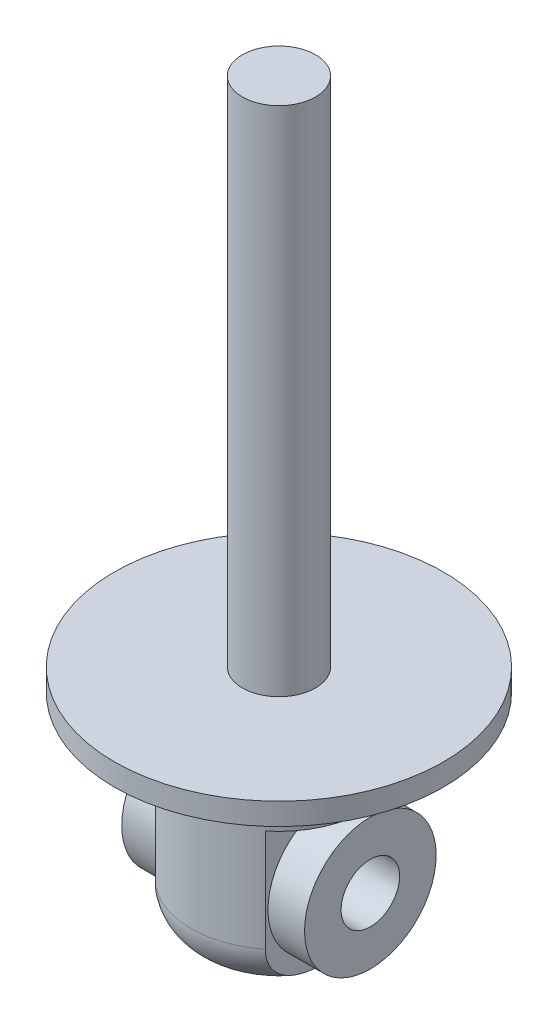
ISO-10303-21;
HEADER;
FILE_DESCRIPTION(('STEP AP214'),'2;1');
FILE_NAME('part.step','',(''),(''),'','','');
FILE_SCHEMA(('AUTOMOTIVE_DESIGN { 1 0 10303 214 1 1 1 1 }'));
ENDSEC;
DATA;
#1=APPLICATION_CONTEXT('core data for automotive mechanical design processes');
#2=APPLICATION_PROTOCOL_DEFINITION('international standard','automotive_design',2000,#1);
#3=PRODUCT_CONTEXT('',#1,'mechanical');
#4=PRODUCT('Part','Part','',(#3));
#5=PRODUCT_RELATED_PRODUCT_CATEGORY('part','',(#4));
#6=PRODUCT_DEFINITION_FORMATION('','',#4);
#7=PRODUCT_DEFINITION_CONTEXT('part definition',#1,'design');
#8=PRODUCT_DEFINITION('design','',#6,#7);
#9=PRODUCT_DEFINITION_SHAPE('','',#8);
#10=(LENGTH_UNIT() NAMED_UNIT(*) SI_UNIT(.MILLI.,.METRE.));
#11=(NAMED_UNIT(*) PLANE_ANGLE_UNIT() SI_UNIT($,.RADIAN.));
#12=(NAMED_UNIT(*) SI_UNIT($,.STERADIAN.) SOLID_ANGLE_UNIT());
#13=UNCERTAINTY_MEASURE_WITH_UNIT(LENGTH_MEASURE(1.E-05),#10,'distance_accuracy_value','');
#14=(GEOMETRIC_REPRESENTATION_CONTEXT(3) GLOBAL_UNCERTAINTY_ASSIGNED_CONTEXT((#13)) GLOBAL_UNIT_ASSIGNED_CONTEXT((#10,
#11,#12)) REPRESENTATION_CONTEXT('',''));
#15=CARTESIAN_POINT('',(0.,0.,0.));
#16=DIRECTION('',(0.,0.,1.));
#17=DIRECTION('',(1.,0.,0.));
#18=AXIS2_PLACEMENT_3D('',#15,#16,#17);
#19=CARTESIAN_POINT('',(-30.,18.1486401523121,-90.0000068191871));
#20=DIRECTION('',(-1.,0.,0.));
#21=DIRECTION('',(0.,0.,1.));
#22=AXIS2_PLACEMENT_3D('',#19,#20,#21);
#23=PLANE('',#22);
#24=DIRECTION('',(0.,1.,0.));
#25=VECTOR('',#24,1.);
#26=CARTESIAN_POINT('',(-30.,-93.8513598476879,37.4699811712033));
#27=LINE('',#26,#25);
#28=CARTESIAN_POINT('',(-30.,-69.8513598476879,37.4699811712033));
#29=VERTEX_POINT('',#28);
#30=CARTESIAN_POINT('',(-30.,-13.8513598476879,37.4699811712033));
#31=VERTEX_POINT('',#30);
#32=EDGE_CURVE('E95',#29,#31,#27,.T.);
#33=ORIENTED_EDGE('',*,*,#32,.T.);
#34=DIRECTION('',(0.,0.,1.));
#35=VECTOR('',#34,1.);
#36=CARTESIAN_POINT('',(-30.,-13.8513598476879,-90.0000068191871));
#37=LINE('',#36,#35);
#38=CARTESIAN_POINT('',(-30.,-13.8513598476879,-37.4699948095775));
#39=VERTEX_POINT('',#38);
#40=EDGE_CURVE('E88',#39,#31,#37,.T.);
#41=ORIENTED_EDGE('',*,*,#40,.F.);
#42=DIRECTION('',(0.,1.,0.));
#43=VECTOR('',#42,1.);
#44=CARTESIAN_POINT('',(-30.,-93.8513598476879,-37.4699948095775));
#45=LINE('',#44,#43);
#46=CARTESIAN_POINT('',(-30.,-69.8513598476879,-37.4699948095775));
#47=VERTEX_POINT('',#46);
#48=EDGE_CURVE('E66',#39,#47,#45,.F.);
#49=ORIENTED_EDGE('',*,*,#48,.T.);
#50=CARTESIAN_POINT('',(-30.,-93.0892599249325,-6.81918706807246E-06));
#51=CARTESIAN_POINT('',(-30.,-93.0892611316607,-0.738052198363597));
#52=CARTESIAN_POINT('',(-30.,-93.0822687729148,-1.47609878089435));
#53=CARTESIAN_POINT('',(-30.,-93.0538144609904,-2.95192256399121));
#54=CARTESIAN_POINT('',(-30.,-93.0323524208549,-3.68969976291177));
#55=CARTESIAN_POINT('',(-30.,-92.9735135445675,-5.16491830483081));
#56=CARTESIAN_POINT('',(-30.,-92.9361306127906,-5.90235941077961));
#57=CARTESIAN_POINT('',(-30.,-92.8431615265196,-7.37609889264012));
#58=CARTESIAN_POINT('',(-30.,-92.7875755883894,-8.11239728202985));
#59=CARTESIAN_POINT('',(-30.,-92.6554566514908,-9.58009944369346));
#60=CARTESIAN_POINT('',(-30.,-92.579011380416,-10.3115108567778));
#61=CARTESIAN_POINT('',(-30.,-92.4015633968189,-11.7713146252248));
#62=CARTESIAN_POINT('',(-30.,-92.3005595739555,-12.4997068425689));
#63=CARTESIAN_POINT('',(-30.,-91.9550034282887,-14.6771646082477));
#64=CARTESIAN_POINT('',(-30.,-91.6677752670836,-16.1201655961783));
#65=CARTESIAN_POINT('',(-30.,-91.1118586745832,-18.3172798826585));
#66=CARTESIAN_POINT('',(-30.,-90.8947929455916,-19.0845664150221));
#67=CARTESIAN_POINT('',(-30.,-90.4124385377801,-20.6040639521541));
#68=CARTESIAN_POINT('',(-30.,-90.1471476929338,-21.3562742780906));
#69=CARTESIAN_POINT('',(-30.,-89.5639546351373,-22.8397070720282));
#70=CARTESIAN_POINT('',(-30.,-89.2460790400504,-23.5709399399755));
#71=CARTESIAN_POINT('',(-30.,-88.5538497312742,-25.0062420015668));
#72=CARTESIAN_POINT('',(-30.,-88.1795056276223,-25.7103157916986));
#73=CARTESIAN_POINT('',(-30.,-87.4347350500955,-26.9765216567793));
#74=CARTESIAN_POINT('',(-30.,-87.0728165333311,-27.5436560514389));
#75=CARTESIAN_POINT('',(-30.,-86.3059797907543,-28.6481491240313));
#76=CARTESIAN_POINT('',(-30.,-85.9010643815308,-29.1855097488436));
#77=CARTESIAN_POINT('',(-30.,-85.04808898298,-30.2251049216939));
#78=CARTESIAN_POINT('',(-30.,-84.6000208874599,-30.7273328393761));
#79=CARTESIAN_POINT('',(-30.,-83.6616854180347,-31.6908217970935));
#80=CARTESIAN_POINT('',(-30.,-83.1714177258861,-32.1520825281261));
#81=CARTESIAN_POINT('',(-30.,-82.1460914034153,-33.0316570706357));
#82=CARTESIAN_POINT('',(-30.,-81.6106753795654,-33.4495555339472));
#83=CARTESIAN_POINT('',(-30.,-80.5019291528832,-34.2318052919914));
#84=CARTESIAN_POINT('',(-30.,-79.928597543178,-34.5961545981429));
#85=CARTESIAN_POINT('',(-30.,-78.7487234624922,-35.2654660856642));
#86=CARTESIAN_POINT('',(-30.,-78.1422047230445,-35.5704700108283));
#87=CARTESIAN_POINT('',(-30.,-76.9009978754799,-36.1163765502656));
#88=CARTESIAN_POINT('',(-30.,-76.2663151952074,-36.3572914539144));
#89=CARTESIAN_POINT('',(-30.,-75.0722609736202,-36.739811611724));
#90=CARTESIAN_POINT('',(-30.,-74.5159103396078,-36.8909014297051));
#91=CARTESIAN_POINT('',(-30.,-73.3918009912041,-37.1419233581533));
#92=CARTESIAN_POINT('',(-30.,-72.824043570507,-37.2418612363285));
#93=CARTESIAN_POINT('',(-30.,-71.6819996799629,-37.3892324892831));
#94=CARTESIAN_POINT('',(-30.,-71.1077160749104,-37.4366880661924));
#95=CARTESIAN_POINT('',(-30.,-69.9572192877116,-37.4785333954683));
#96=CARTESIAN_POINT('',(-30.,-69.3810061734218,-37.4729249947871));
#97=CARTESIAN_POINT('',(-30.,-68.2760233941342,-37.4112147049101));
#98=CARTESIAN_POINT('',(-30.,-67.7470294508587,-37.3590495480717));
#99=CARTESIAN_POINT('',(-30.,-66.6953717541003,-37.2102239386462));
#100=CARTESIAN_POINT('',(-30.,-66.1727075674064,-37.1135665489885));
#101=CARTESIAN_POINT('',(-30.,-65.137433890027,-36.8768691294685));
#102=CARTESIAN_POINT('',(-30.,-64.6248222375744,-36.7368385381173));
#103=CARTESIAN_POINT('',(-30.,-63.6129195009735,-36.4149236425133));
#104=CARTESIAN_POINT('',(-30.,-63.1136287487036,-36.2330382965711));
#105=CARTESIAN_POINT('',(-30.,-62.1280878985299,-35.8279581985301));
#106=CARTESIAN_POINT('',(-30.,-61.6419515087085,-35.6044871560991));
#107=CARTESIAN_POINT('',(-30.,-60.6891363553551,-35.1193972117624));
#108=CARTESIAN_POINT('',(-30.,-60.2224574643725,-34.8577785597818));
#109=CARTESIAN_POINT('',(-30.,-59.310773908771,-34.2988771365567));
#110=CARTESIAN_POINT('',(-30.,-58.8657769727852,-34.0015817770705));
#111=CARTESIAN_POINT('',(-30.,-57.9995739133805,-33.3741742734401));
#112=CARTESIAN_POINT('',(-30.,-57.5783688426015,-33.0440606790763));
#113=CARTESIAN_POINT('',(-30.,-56.7293350556522,-32.3269361932505));
#114=CARTESIAN_POINT('',(-30.,-56.3035594479762,-31.9374950764825));
#115=CARTESIAN_POINT('',(-30.,-55.4827570971635,-31.1275174828152));
#116=CARTESIAN_POINT('',(-30.,-55.0877312041988,-30.7069801467901));
#117=CARTESIAN_POINT('',(-30.,-54.3293265039809,-29.8386238330802));
#118=CARTESIAN_POINT('',(-30.,-53.9659349215399,-29.3908159936417));
#119=CARTESIAN_POINT('',(-30.,-53.2707864350541,-28.4712385046426));
#120=CARTESIAN_POINT('',(-30.,-52.9390363688606,-27.9994637093405));
#121=CARTESIAN_POINT('',(-30.,-52.1493074181579,-26.7947904121129));
#122=CARTESIAN_POINT('',(-30.,-51.7108854708201,-26.0490011637348));
#123=CARTESIAN_POINT('',(-30.,-50.9020716606715,-24.5213303960724));
#124=CARTESIAN_POINT('',(-30.,-50.5317123306957,-23.7394318393898));
#125=CARTESIAN_POINT('',(-30.,-49.8539005931896,-22.1463721782566));
#126=CARTESIAN_POINT('',(-30.,-49.5466308919115,-21.3351338688782));
#127=CARTESIAN_POINT('',(-30.,-48.990849279687,-19.6932432865343));
#128=CARTESIAN_POINT('',(-30.,-48.7423210565885,-18.8625964737647));
#129=CARTESIAN_POINT('',(-30.,-48.2629337769052,-17.0573373338172));
#130=CARTESIAN_POINT('',(-30.,-48.040828221803,-16.0804193679996));
#131=CARTESIAN_POINT('',(-30.,-47.6559178919993,-14.1149201518687));
#132=CARTESIAN_POINT('',(-30.,-47.4931322311057,-13.1263352480245));
#133=CARTESIAN_POINT('',(-30.,-47.2163378803163,-11.140289851927));
#134=CARTESIAN_POINT('',(-30.,-47.102436720032,-10.1428146701659));
#135=CARTESIAN_POINT('',(-30.,-46.9616088660944,-8.6439788310222));
#136=CARTESIAN_POINT('',(-30.,-46.9196712276942,-8.14394829683787));
#137=CARTESIAN_POINT('',(-30.,-46.8448164166611,-7.14321213759518));
#138=CARTESIAN_POINT('',(-30.,-46.8118991301461,-6.64250652113995));
#139=CARTESIAN_POINT('',(-30.,-46.7540692721684,-5.6380618556896));
#140=CARTESIAN_POINT('',(-30.,-46.729198661424,-5.1343204298399));
#141=CARTESIAN_POINT('',(-30.,-46.6869836847153,-4.1265321744669));
#142=CARTESIAN_POINT('',(-30.,-46.6696392052213,-3.62248534966533));
#143=CARTESIAN_POINT('',(-30.,-46.6419472390074,-2.61417711028704));
#144=CARTESIAN_POINT('',(-30.,-46.6316000943294,-2.10991568642577));
#145=CARTESIAN_POINT('',(-30.,-46.6175757344641,-1.1012996440096));
#146=CARTESIAN_POINT('',(-30.,-46.6138985375758,-0.596945025202812));
#147=CARTESIAN_POINT('',(-30.,-46.613095256448,0.411163385613465));
#148=CARTESIAN_POINT('',(-30.,-46.6159613065268,0.914917171444938));
#149=CARTESIAN_POINT('',(-30.,-46.628321309575,1.92234597200099));
#150=CARTESIAN_POINT('',(-30.,-46.6378152851368,2.42602098645122));
#151=CARTESIAN_POINT('',(-30.,-46.6637318481209,3.43315472088317));
#152=CARTESIAN_POINT('',(-30.,-46.6801538847655,3.93661345487485));
#153=CARTESIAN_POINT('',(-30.,-46.7204282328483,4.94322788363524));
#154=CARTESIAN_POINT('',(-30.,-46.7442804266004,5.44638358307725));
#155=CARTESIAN_POINT('',(-30.,-46.8027636425445,6.50023992410521));
#156=CARTESIAN_POINT('',(-30.,-46.8382059876979,7.05089623266971));
#157=CARTESIAN_POINT('',(-30.,-46.919957971471,8.15140187734522));
#158=CARTESIAN_POINT('',(-30.,-46.966267496773,8.70125122181071));
#159=CARTESIAN_POINT('',(-30.,-47.0710989801583,9.79989486485605));
#160=CARTESIAN_POINT('',(-30.,-47.1296229826125,10.3486889712801));
#161=CARTESIAN_POINT('',(-30.,-47.260379767074,11.4446308569511));
#162=CARTESIAN_POINT('',(-30.,-47.3326125428379,11.9917786369477));
#163=CARTESIAN_POINT('',(-30.,-47.5715585799602,13.6248737418128));
#164=CARTESIAN_POINT('',(-30.,-47.7609838531774,14.7076553969787));
#165=CARTESIAN_POINT('',(-30.,-48.2141857445342,16.8575846999504));
#166=CARTESIAN_POINT('',(-30.,-48.4779382081889,17.9247373084835));
#167=CARTESIAN_POINT('',(-30.,-49.0160585174062,19.7685804752265));
#168=CARTESIAN_POINT('',(-30.,-49.2711097031378,20.5508843619595));
#169=CARTESIAN_POINT('',(-30.,-49.835763414559,22.0957231375065));
#170=CARTESIAN_POINT('',(-30.,-50.1453667211977,22.8582577431309));
#171=CARTESIAN_POINT('',(-30.,-50.8237006897191,24.356907996577));
#172=CARTESIAN_POINT('',(-30.,-51.1924326101962,25.0930230816321));
#173=CARTESIAN_POINT('',(-30.,-51.7921426850689,26.1709549249958));
#174=CARTESIAN_POINT('',(-30.,-51.999799681092,26.525869785905));
#175=CARTESIAN_POINT('',(-30.,-52.4310209415023,27.2260387321158));
#176=CARTESIAN_POINT('',(-30.,-52.6545891732071,27.5712903778755));
#177=CARTESIAN_POINT('',(-30.,-53.2464309242116,28.4396035161559));
#178=CARTESIAN_POINT('',(-30.,-53.6261280631121,28.9549572541211));
#179=CARTESIAN_POINT('',(-30.,-54.4244336347113,29.9544432671431));
#180=CARTESIAN_POINT('',(-30.,-54.8430332509361,30.4385825744085));
#181=CARTESIAN_POINT('',(-30.,-55.7185409335278,31.3708069946439));
#182=CARTESIAN_POINT('',(-30.,-56.1754406165184,31.8188999558184));
#183=CARTESIAN_POINT('',(-30.,-57.1261897842569,32.6741274509997));
#184=CARTESIAN_POINT('',(-30.,-57.6200399677405,33.0812612101246));
#185=CARTESIAN_POINT('',(-30.,-58.6461732042846,33.8524397493987));
#186=CARTESIAN_POINT('',(-30.,-59.1787151111166,34.2161410164972));
#187=CARTESIAN_POINT('',(-30.,-60.2756443842691,34.8920128006311));
#188=CARTESIAN_POINT('',(-30.,-60.8400325473068,35.20418202769));
#189=CARTESIAN_POINT('',(-30.,-61.9961874594725,35.7723720464126));
#190=CARTESIAN_POINT('',(-30.,-62.5879438775699,36.0284138190565));
#191=CARTESIAN_POINT('',(-30.,-63.793911950484,36.4805676203198));
#192=CARTESIAN_POINT('',(-30.,-64.4081204213939,36.6766881096964));
#193=CARTESIAN_POINT('',(-30.,-65.5768155799712,36.9857288686384));
#194=CARTESIAN_POINT('',(-30.,-66.1293949347761,37.1059005642837));
#195=CARTESIAN_POINT('',(-30.,-67.2430859659713,37.296238896397));
#196=CARTESIAN_POINT('',(-30.,-67.8041968699957,37.3664100322382));
#197=CARTESIAN_POINT('',(-30.,-68.9302382881383,37.455833275237));
#198=CARTESIAN_POINT('',(-30.,-69.4951672234347,37.4751052758845));
#199=CARTESIAN_POINT('',(-30.,-70.6244535976211,37.4625377321111));
#200=CARTESIAN_POINT('',(-30.,-71.1888110505129,37.4306994718235));
#201=CARTESIAN_POINT('',(-30.,-72.2770638413488,37.319925635093));
#202=CARTESIAN_POINT('',(-30.,-72.8012758257346,37.2440710470996));
#203=CARTESIAN_POINT('',(-30.,-73.8414667937806,37.0486995362486));
#204=CARTESIAN_POINT('',(-30.,-74.3574462404068,36.9291850777487));
#205=CARTESIAN_POINT('',(-30.,-75.3776517364844,36.6478282433836));
#206=CARTESIAN_POINT('',(-30.,-75.8818790847987,36.4859905695482));
#207=CARTESIAN_POINT('',(-30.,-76.8754410114704,36.1217165848684));
#208=CARTESIAN_POINT('',(-30.,-77.3647751791612,35.9192791556868));
#209=CARTESIAN_POINT('',(-30.,-78.3336699712591,35.472205623011));
#210=CARTESIAN_POINT('',(-30.,-78.8129315899242,35.2269221865305));
#211=CARTESIAN_POINT('',(-30.,-79.7504290614741,34.6990772361913));
#212=CARTESIAN_POINT('',(-30.,-80.20866490053,34.4165156978148));
#213=CARTESIAN_POINT('',(-30.,-81.102008010542,33.8167991465054));
#214=CARTESIAN_POINT('',(-30.,-81.5371106229795,33.4996372047693));
#215=CARTESIAN_POINT('',(-30.,-82.382354122105,32.8336631307682));
#216=CARTESIAN_POINT('',(-30.,-82.7924938874912,32.4848495785004));
#217=CARTESIAN_POINT('',(-30.,-83.6212582978309,31.7267637725649));
#218=CARTESIAN_POINT('',(-30.,-84.0374864085922,31.3148719755993));
#219=CARTESIAN_POINT('',(-30.,-84.8378013152369,30.4610261306246));
#220=CARTESIAN_POINT('',(-30.,-85.2218870497033,30.0190710907295));
#221=CARTESIAN_POINT('',(-30.,-85.9574549927598,29.1088228532463));
#222=CARTESIAN_POINT('',(-30.,-86.3089354615389,28.6405282523232));
#223=CARTESIAN_POINT('',(-30.,-86.9793740502017,27.6811571970972));
#224=CARTESIAN_POINT('',(-30.,-87.2983246593579,27.1900755194596));
#225=CARTESIAN_POINT('',(-30.,-88.0691877143732,25.9156883561653));
#226=CARTESIAN_POINT('',(-30.,-88.4989160842426,25.1188847962624));
#227=CARTESIAN_POINT('',(-30.,-89.2856458140668,23.4901092399801));
#228=CARTESIAN_POINT('',(-30.,-89.6426122273919,22.6581205751907));
#229=CARTESIAN_POINT('',(-30.,-90.2898326401251,20.9672411376953));
#230=CARTESIAN_POINT('',(-30.,-90.5799763629775,20.1083085159763));
#231=CARTESIAN_POINT('',(-30.,-91.0997695867003,18.3721819773498));
#232=CARTESIAN_POINT('',(-30.,-91.3293964132553,17.4949813482813));
#233=CARTESIAN_POINT('',(-30.,-91.6883385112106,15.9340832319027));
#234=CARTESIAN_POINT('',(-30.,-91.8285626417853,15.2528412719452));
#235=CARTESIAN_POINT('',(-30.,-92.0812643111244,13.8854123657106));
#236=CARTESIAN_POINT('',(-30.,-92.1937479229421,13.1992265356788));
#237=CARTESIAN_POINT('',(-30.,-92.3944937666707,11.8229159102374));
#238=CARTESIAN_POINT('',(-30.,-92.4827403005,11.1327888560953));
#239=CARTESIAN_POINT('',(-30.,-92.6381481818878,9.75015460022858));
#240=CARTESIAN_POINT('',(-30.,-92.7053082968371,9.05764726175541));
#241=CARTESIAN_POINT('',(-30.,-92.8216032432864,7.66895510798233));
#242=CARTESIAN_POINT('',(-30.,-92.8706808139922,6.97276557322258));
#243=CARTESIAN_POINT('',(-30.,-92.9529494773895,5.57947661606538));
#244=CARTESIAN_POINT('',(-30.,-92.9861408335073,4.8823772089477));
#245=CARTESIAN_POINT('',(-30.,-93.0384716333854,3.48784684379134));
#246=CARTESIAN_POINT('',(-30.,-93.0576148123181,2.79041602325476));
#247=CARTESIAN_POINT('',(-30.,-93.0830084202225,1.39532155461287));
#248=CARTESIAN_POINT('',(-30.,-93.0892587842279,0.697657905352055));
#249=CARTESIAN_POINT('',(-30.,-93.0892599249325,-6.81918706807246E-06));
#250=B_SPLINE_CURVE_WITH_KNOTS('',3,(#50,#51,#52,#53,#54,#55,#56,#57,#58,#59,#60,#61,#62,#63,
#64,#65,#66,#67,#68,#69,#70,#71,#72,#73,#74,#75,#76,#77,#78,#79,#80,#81,#82,#83,#84,#85,#86,#87,
#88,#89,#90,#91,#92,#93,#94,#95,#96,#97,#98,#99,#100,#101,#102,#103,#104,#105,#106,#107,#108,
#109,#110,#111,#112,#113,#114,#115,#116,#117,#118,#119,#120,#121,#122,#123,#124,#125,#126,#127,
#128,#129,#130,#131,#132,#133,#134,#135,#136,#137,#138,#139,#140,#141,#142,#143,#144,#145,#146,
#147,#148,#149,#150,#151,#152,#153,#154,#155,#156,#157,#158,#159,#160,#161,#162,#163,#164,#165,
#166,#167,#168,#169,#170,#171,#172,#173,#174,#175,#176,#177,#178,#179,#180,#181,#182,#183,#184,
#185,#186,#187,#188,#189,#190,#191,#192,#193,#194,#195,#196,#197,#198,#199,#200,#201,#202,#203,
#204,#205,#206,#207,#208,#209,#210,#211,#212,#213,#214,#215,#216,#217,#218,#219,#220,#221,#222,
#223,#224,#225,#226,#227,#228,#229,#230,#231,#232,#233,#234,#235,#236,#237,#238,#239,#240,#241,
#242,#243,#244,#245,#246,#247,#248,#249),.UNSPECIFIED.,.T.,.F.,(4,2,2,2,2,2,2,2,2,2,2,2,2,2,2,2,
2,2,2,2,2,2,2,2,2,2,2,2,2,2,2,2,2,2,2,2,2,2,2,2,2,2,2,2,2,2,2,2,2,2,2,2,2,2,2,2,2,2,2,2,2,2,2,2,
2,2,2,2,2,2,2,2,2,2,2,2,2,2,2,2,2,2,2,2,2,2,2,2,2,2,2,2,2,2,2,2,2,2,2,4),(0.,2.21410330807653,
4.42821992214618,6.64318501727892,8.85812378592945,11.0638871062463,13.2697501720634,
17.6765078037139,20.0674267702985,22.4584531513217,24.8482729020421,27.2376864015397,
29.254159466955,31.2705005210631,33.2872210845387,35.3039568582163,37.3385068375633,
39.3731323521038,41.4063214870767,43.4391204668517,45.166343421461,46.8933715777161,
48.6196688516129,50.3459060399882,51.938702610761,53.531389546801,55.1237301389257,
56.7161103658282,58.3194745274512,59.922828185062,61.5267492458629,63.1307412145684,
64.8600382553431,66.5893830909627,68.3180262770983,70.0470421871384,72.6383221057377,
75.2308374110988,77.8307578635283,80.4299554833424,83.4332317454108,86.4374748566922,
89.448292847705,90.9535902133531,92.4588685737193,93.9718744700121,95.4848575422015,
96.9979145662968,98.5109757414482,100.022219013334,101.53346743654,103.044595738806,
104.555700107546,106.210989398991,107.86626143065,109.521810732272,111.177359279911,
114.472866133878,117.767303262801,120.234018615271,122.700769283245,125.167572464727,
126.400813220428,127.63436255782,129.552808392758,131.470820505396,133.388413881442,
135.306043528434,137.237955740522,139.169916305893,141.101153449708,143.032117780814,
144.726405316987,146.420540370965,148.114013188755,149.807443459104,151.394602139799,
152.981671248024,154.568564110702,156.155500691009,157.768897601399,159.382295572924,
160.996017225885,162.609811311916,164.364782507237,166.119811632991,167.874934352988,
169.630461395286,172.342030445901,175.054898775371,177.772212536212,180.490542970406,
182.576521556741,184.662043067018,186.748912177602,188.835903253678,190.929447394874,
193.02295681957,195.115909413669,197.20887255403),.UNSPECIFIED.);
#251=EDGE_CURVE('E145',#29,#47,#250,.T.);
#252=ORIENTED_EDGE('',*,*,#251,.F.);
#253=EDGE_LOOP('',(#33,#41,#49,#252));
#254=FACE_BOUND('',#253,.T.);
#255=CARTESIAN_POINT('',(-30.,-51.983828865234,-6.81918706807246E-06));
#256=DIRECTION('',(-1.,0.,0.));
#257=DIRECTION('',(0.,0.,1.));
#258=AXIS2_PLACEMENT_3D('',#255,#256,#257);
#259=CIRCLE('',#258,36.);
#260=CARTESIAN_POINT('',(-30.,-51.983828865234,35.9999931808129));
#261=VERTEX_POINT('',#260);
#262=EDGE_CURVE('E98',#261,#261,#259,.F.);
#263=ORIENTED_EDGE('',*,*,#262,.T.);
#264=EDGE_LOOP('',(#263));
#265=FACE_BOUND('',#264,.T.);
#266=ADVANCED_FACE('F41',(#254,#265),#23,.T.);
#267=CARTESIAN_POINT('',(30.,18.1486401523121,-90.0000068191871));
#268=DIRECTION('',(-1.,0.,0.));
#269=DIRECTION('',(0.,0.,1.));
#270=AXIS2_PLACEMENT_3D('',#267,#268,#269);
#271=PLANE('',#270);
#272=CARTESIAN_POINT('',(30.,-93.0892599249325,-6.81918706807246E-06));
#273=CARTESIAN_POINT('',(30.,-93.0892611316607,-0.738052198363597));
#274=CARTESIAN_POINT('',(30.,-93.0822687729148,-1.47609878089435));
#275=CARTESIAN_POINT('',(30.,-93.0538144609904,-2.95192256399121));
#276=CARTESIAN_POINT('',(30.,-93.0323524208549,-3.68969976291177));
#277=CARTESIAN_POINT('',(30.,-92.9735135445675,-5.16491830483081));
#278=CARTESIAN_POINT('',(30.,-92.9361306127906,-5.90235941077961));
#279=CARTESIAN_POINT('',(30.,-92.8431615265196,-7.37609889264012));
#280=CARTESIAN_POINT('',(30.,-92.7875755883894,-8.11239728202985));
#281=CARTESIAN_POINT('',(30.,-92.6554566514908,-9.58009944369346));
#282=CARTESIAN_POINT('',(30.,-92.579011380416,-10.3115108567778));
#283=CARTESIAN_POINT('',(30.,-92.4015633968189,-11.7713146252248));
#284=CARTESIAN_POINT('',(30.,-92.3005595739555,-12.4997068425689));
#285=CARTESIAN_POINT('',(30.,-91.9550034282887,-14.6771646082477));
#286=CARTESIAN_POINT('',(30.,-91.6677752670836,-16.1201655961783));
#287=CARTESIAN_POINT('',(30.,-91.1118586745832,-18.3172798826585));
#288=CARTESIAN_POINT('',(30.,-90.8947929455916,-19.0845664150221));
#289=CARTESIAN_POINT('',(30.,-90.4124385377801,-20.6040639521541));
#290=CARTESIAN_POINT('',(30.,-90.1471476929338,-21.3562742780906));
#291=CARTESIAN_POINT('',(30.,-89.5639546351373,-22.8397070720282));
#292=CARTESIAN_POINT('',(30.,-89.2460790400504,-23.5709399399755));
#293=CARTESIAN_POINT('',(30.,-88.5538497312742,-25.0062420015668));
#294=CARTESIAN_POINT('',(30.,-88.1795056276223,-25.7103157916986));
#295=CARTESIAN_POINT('',(30.,-87.4347350500955,-26.9765216567793));
#296=CARTESIAN_POINT('',(30.,-87.0728165333311,-27.5436560514389));
#297=CARTESIAN_POINT('',(30.,-86.3059797907543,-28.6481491240313));
#298=CARTESIAN_POINT('',(30.,-85.9010643815308,-29.1855097488436));
#299=CARTESIAN_POINT('',(30.,-85.04808898298,-30.2251049216939));
#300=CARTESIAN_POINT('',(30.,-84.6000208874599,-30.7273328393761));
#301=CARTESIAN_POINT('',(30.,-83.6616854180347,-31.6908217970935));
#302=CARTESIAN_POINT('',(30.,-83.1714177258861,-32.1520825281261));
#303=CARTESIAN_POINT('',(30.,-82.1460914034153,-33.0316570706357));
#304=CARTESIAN_POINT('',(30.,-81.6106753795654,-33.4495555339472));
#305=CARTESIAN_POINT('',(30.,-80.5019291528832,-34.2318052919914));
#306=CARTESIAN_POINT('',(30.,-79.928597543178,-34.5961545981429));
#307=CARTESIAN_POINT('',(30.,-78.7487234624922,-35.2654660856642));
#308=CARTESIAN_POINT('',(30.,-78.1422047230445,-35.5704700108283));
#309=CARTESIAN_POINT('',(30.,-76.9009978754799,-36.1163765502656));
#310=CARTESIAN_POINT('',(30.,-76.2663151952074,-36.3572914539144));
#311=CARTESIAN_POINT('',(30.,-75.0722609736202,-36.739811611724));
#312=CARTESIAN_POINT('',(30.,-74.5159103396078,-36.8909014297051));
#313=CARTESIAN_POINT('',(30.,-73.3918009912041,-37.1419233581533));
#314=CARTESIAN_POINT('',(30.,-72.824043570507,-37.2418612363285));
#315=CARTESIAN_POINT('',(30.,-71.6819996799629,-37.3892324892831));
#316=CARTESIAN_POINT('',(30.,-71.1077160749104,-37.4366880661924));
#317=CARTESIAN_POINT('',(30.,-69.9572192877116,-37.4785333954683));
#318=CARTESIAN_POINT('',(30.,-69.3810061734218,-37.4729249947871));
#319=CARTESIAN_POINT('',(30.,-68.2760233941342,-37.4112147049101));
#320=CARTESIAN_POINT('',(30.,-67.7470294508587,-37.3590495480717));
#321=CARTESIAN_POINT('',(30.,-66.6953717541003,-37.2102239386462));
#322=CARTESIAN_POINT('',(30.,-66.1727075674064,-37.1135665489885));
#323=CARTESIAN_POINT('',(30.,-65.137433890027,-36.8768691294685));
#324=CARTESIAN_POINT('',(30.,-64.6248222375744,-36.7368385381173));
#325=CARTESIAN_POINT('',(30.,-63.6129195009735,-36.4149236425133));
#326=CARTESIAN_POINT('',(30.,-63.1136287487036,-36.2330382965711));
#327=CARTESIAN_POINT('',(30.,-62.1280878985299,-35.8279581985301));
#328=CARTESIAN_POINT('',(30.,-61.6419515087085,-35.6044871560991));
#329=CARTESIAN_POINT('',(30.,-60.6891363553551,-35.1193972117624));
#330=CARTESIAN_POINT('',(30.,-60.2224574643725,-34.8577785597818));
#331=CARTESIAN_POINT('',(30.,-59.310773908771,-34.2988771365567));
#332=CARTESIAN_POINT('',(30.,-58.8657769727852,-34.0015817770705));
#333=CARTESIAN_POINT('',(30.,-57.9995739133805,-33.3741742734401));
#334=CARTESIAN_POINT('',(30.,-57.5783688426015,-33.0440606790763));
#335=CARTESIAN_POINT('',(30.,-56.7293350556522,-32.3269361932505));
#336=CARTESIAN_POINT('',(30.,-56.3035594479762,-31.9374950764825));
#337=CARTESIAN_POINT('',(30.,-55.4827570971635,-31.1275174828152));
#338=CARTESIAN_POINT('',(30.,-55.0877312041988,-30.7069801467901));
#339=CARTESIAN_POINT('',(30.,-54.3293265039809,-29.8386238330802));
#340=CARTESIAN_POINT('',(30.,-53.9659349215399,-29.3908159936417));
#341=CARTESIAN_POINT('',(30.,-53.2707864350541,-28.4712385046426));
#342=CARTESIAN_POINT('',(30.,-52.9390363688606,-27.9994637093405));
#343=CARTESIAN_POINT('',(30.,-52.1493074181579,-26.7947904121129));
#344=CARTESIAN_POINT('',(30.,-51.7108854708201,-26.0490011637348));
#345=CARTESIAN_POINT('',(30.,-50.9020716606715,-24.5213303960724));
#346=CARTESIAN_POINT('',(30.,-50.5317123306957,-23.7394318393898));
#347=CARTESIAN_POINT('',(30.,-49.8539005931896,-22.1463721782566));
#348=CARTESIAN_POINT('',(30.,-49.5466308919115,-21.3351338688782));
#349=CARTESIAN_POINT('',(30.,-48.990849279687,-19.6932432865343));
#350=CARTESIAN_POINT('',(30.,-48.7423210565885,-18.8625964737647));
#351=CARTESIAN_POINT('',(30.,-48.2629337769052,-17.0573373338172));
#352=CARTESIAN_POINT('',(30.,-48.040828221803,-16.0804193679996));
#353=CARTESIAN_POINT('',(30.,-47.6559178919993,-14.1149201518687));
#354=CARTESIAN_POINT('',(30.,-47.4931322311057,-13.1263352480245));
#355=CARTESIAN_POINT('',(30.,-47.2163378803163,-11.140289851927));
#356=CARTESIAN_POINT('',(30.,-47.102436720032,-10.1428146701659));
#357=CARTESIAN_POINT('',(30.,-46.9616088660944,-8.6439788310222));
#358=CARTESIAN_POINT('',(30.,-46.9196712276942,-8.14394829683787));
#359=CARTESIAN_POINT('',(30.,-46.8448164166611,-7.14321213759518));
#360=CARTESIAN_POINT('',(30.,-46.8118991301461,-6.64250652113995));
#361=CARTESIAN_POINT('',(30.,-46.7540692721684,-5.6380618556896));
#362=CARTESIAN_POINT('',(30.,-46.729198661424,-5.1343204298399));
#363=CARTESIAN_POINT('',(30.,-46.6869836847153,-4.1265321744669));
#364=CARTESIAN_POINT('',(30.,-46.6696392052213,-3.62248534966533));
#365=CARTESIAN_POINT('',(30.,-46.6419472390074,-2.61417711028704));
#366=CARTESIAN_POINT('',(30.,-46.6316000943294,-2.10991568642577));
#367=CARTESIAN_POINT('',(30.,-46.6175757344641,-1.1012996440096));
#368=CARTESIAN_POINT('',(30.,-46.6138985375758,-0.596945025202812));
#369=CARTESIAN_POINT('',(30.,-46.613095256448,0.411163385613465));
#370=CARTESIAN_POINT('',(30.,-46.6159613065268,0.914917171444938));
#371=CARTESIAN_POINT('',(30.,-46.628321309575,1.92234597200099));
#372=CARTESIAN_POINT('',(30.,-46.6378152851368,2.42602098645122));
#373=CARTESIAN_POINT('',(30.,-46.6637318481209,3.43315472088317));
#374=CARTESIAN_POINT('',(30.,-46.6801538847655,3.93661345487485));
#375=CARTESIAN_POINT('',(30.,-46.7204282328483,4.94322788363524));
#376=CARTESIAN_POINT('',(30.,-46.7442804266004,5.44638358307725));
#377=CARTESIAN_POINT('',(30.,-46.8027636425445,6.50023992410521));
#378=CARTESIAN_POINT('',(30.,-46.8382059876979,7.05089623266971));
#379=CARTESIAN_POINT('',(30.,-46.919957971471,8.15140187734522));
#380=CARTESIAN_POINT('',(30.,-46.966267496773,8.70125122181071));
#381=CARTESIAN_POINT('',(30.,-47.0710989801583,9.79989486485605));
#382=CARTESIAN_POINT('',(30.,-47.1296229826125,10.3486889712801));
#383=CARTESIAN_POINT('',(30.,-47.260379767074,11.4446308569511));
#384=CARTESIAN_POINT('',(30.,-47.3326125428379,11.9917786369477));
#385=CARTESIAN_POINT('',(30.,-47.5715585799602,13.6248737418128));
#386=CARTESIAN_POINT('',(30.,-47.7609838531774,14.7076553969787));
#387=CARTESIAN_POINT('',(30.,-48.2141857445342,16.8575846999504));
#388=CARTESIAN_POINT('',(30.,-48.4779382081889,17.9247373084835));
#389=CARTESIAN_POINT('',(30.,-49.0160585174062,19.7685804752265));
#390=CARTESIAN_POINT('',(30.,-49.2711097031378,20.5508843619595));
#391=CARTESIAN_POINT('',(30.,-49.835763414559,22.0957231375065));
#392=CARTESIAN_POINT('',(30.,-50.1453667211977,22.8582577431309));
#393=CARTESIAN_POINT('',(30.,-50.8237006897191,24.356907996577));
#394=CARTESIAN_POINT('',(30.,-51.1924326101962,25.0930230816321));
#395=CARTESIAN_POINT('',(30.,-51.7921426850689,26.1709549249958));
#396=CARTESIAN_POINT('',(30.,-51.999799681092,26.525869785905));
#397=CARTESIAN_POINT('',(30.,-52.4310209415023,27.2260387321158));
#398=CARTESIAN_POINT('',(30.,-52.6545891732071,27.5712903778755));
#399=CARTESIAN_POINT('',(30.,-53.2464309242116,28.4396035161559));
#400=CARTESIAN_POINT('',(30.,-53.6261280631121,28.9549572541211));
#401=CARTESIAN_POINT('',(30.,-54.4244336347113,29.9544432671431));
#402=CARTESIAN_POINT('',(30.,-54.8430332509361,30.4385825744085));
#403=CARTESIAN_POINT('',(30.,-55.7185409335278,31.3708069946439));
#404=CARTESIAN_POINT('',(30.,-56.1754406165184,31.8188999558184));
#405=CARTESIAN_POINT('',(30.,-57.1261897842569,32.6741274509997));
#406=CARTESIAN_POINT('',(30.,-57.6200399677405,33.0812612101246));
#407=CARTESIAN_POINT('',(30.,-58.6461732042846,33.8524397493987));
#408=CARTESIAN_POINT('',(30.,-59.1787151111166,34.2161410164972));
#409=CARTESIAN_POINT('',(30.,-60.2756443842691,34.8920128006311));
#410=CARTESIAN_POINT('',(30.,-60.8400325473068,35.20418202769));
#411=CARTESIAN_POINT('',(30.,-61.9961874594725,35.7723720464126));
#412=CARTESIAN_POINT('',(30.,-62.5879438775699,36.0284138190565));
#413=CARTESIAN_POINT('',(30.,-63.793911950484,36.4805676203198));
#414=CARTESIAN_POINT('',(30.,-64.4081204213939,36.6766881096964));
#415=CARTESIAN_POINT('',(30.,-65.5768155799712,36.9857288686384));
#416=CARTESIAN_POINT('',(30.,-66.1293949347761,37.1059005642837));
#417=CARTESIAN_POINT('',(30.,-67.2430859659713,37.296238896397));
#418=CARTESIAN_POINT('',(30.,-67.8041968699957,37.3664100322382));
#419=CARTESIAN_POINT('',(30.,-68.9302382881383,37.455833275237));
#420=CARTESIAN_POINT('',(30.,-69.4951672234347,37.4751052758845));
#421=CARTESIAN_POINT('',(30.,-70.6244535976211,37.4625377321111));
#422=CARTESIAN_POINT('',(30.,-71.1888110505129,37.4306994718235));
#423=CARTESIAN_POINT('',(30.,-72.2770638413488,37.319925635093));
#424=CARTESIAN_POINT('',(30.,-72.8012758257346,37.2440710470996));
#425=CARTESIAN_POINT('',(30.,-73.8414667937806,37.0486995362486));
#426=CARTESIAN_POINT('',(30.,-74.3574462404068,36.9291850777487));
#427=CARTESIAN_POINT('',(30.,-75.3776517364844,36.6478282433836));
#428=CARTESIAN_POINT('',(30.,-75.8818790847987,36.4859905695482));
#429=CARTESIAN_POINT('',(30.,-76.8754410114704,36.1217165848684));
#430=CARTESIAN_POINT('',(30.,-77.3647751791612,35.9192791556868));
#431=CARTESIAN_POINT('',(30.,-78.3336699712591,35.472205623011));
#432=CARTESIAN_POINT('',(30.,-78.8129315899242,35.2269221865305));
#433=CARTESIAN_POINT('',(30.,-79.7504290614741,34.6990772361913));
#434=CARTESIAN_POINT('',(30.,-80.20866490053,34.4165156978148));
#435=CARTESIAN_POINT('',(30.,-81.102008010542,33.8167991465054));
#436=CARTESIAN_POINT('',(30.,-81.5371106229795,33.4996372047693));
#437=CARTESIAN_POINT('',(30.,-82.382354122105,32.8336631307682));
#438=CARTESIAN_POINT('',(30.,-82.7924938874912,32.4848495785004));
#439=CARTESIAN_POINT('',(30.,-83.6212582978309,31.7267637725649));
#440=CARTESIAN_POINT('',(30.,-84.0374864085922,31.3148719755993));
#441=CARTESIAN_POINT('',(30.,-84.8378013152369,30.4610261306246));
#442=CARTESIAN_POINT('',(30.,-85.2218870497033,30.0190710907295));
#443=CARTESIAN_POINT('',(30.,-85.9574549927598,29.1088228532463));
#444=CARTESIAN_POINT('',(30.,-86.3089354615389,28.6405282523232));
#445=CARTESIAN_POINT('',(30.,-86.9793740502017,27.6811571970972));
#446=CARTESIAN_POINT('',(30.,-87.2983246593579,27.1900755194596));
#447=CARTESIAN_POINT('',(30.,-88.0691877143732,25.9156883561653));
#448=CARTESIAN_POINT('',(30.,-88.4989160842426,25.1188847962624));
#449=CARTESIAN_POINT('',(30.,-89.2856458140668,23.4901092399801));
#450=CARTESIAN_POINT('',(30.,-89.6426122273919,22.6581205751907));
#451=CARTESIAN_POINT('',(30.,-90.2898326401251,20.9672411376953));
#452=CARTESIAN_POINT('',(30.,-90.5799763629775,20.1083085159763));
#453=CARTESIAN_POINT('',(30.,-91.0997695867003,18.3721819773498));
#454=CARTESIAN_POINT('',(30.,-91.3293964132553,17.4949813482813));
#455=CARTESIAN_POINT('',(30.,-91.6883385112106,15.9340832319027));
#456=CARTESIAN_POINT('',(30.,-91.8285626417853,15.2528412719452));
#457=CARTESIAN_POINT('',(30.,-92.0812643111244,13.8854123657106));
#458=CARTESIAN_POINT('',(30.,-92.1937479229421,13.1992265356788));
#459=CARTESIAN_POINT('',(30.,-92.3944937666707,11.8229159102374));
#460=CARTESIAN_POINT('',(30.,-92.4827403005,11.1327888560953));
#461=CARTESIAN_POINT('',(30.,-92.6381481818878,9.75015460022858));
#462=CARTESIAN_POINT('',(30.,-92.7053082968371,9.05764726175541));
#463=CARTESIAN_POINT('',(30.,-92.8216032432864,7.66895510798233));
#464=CARTESIAN_POINT('',(30.,-92.8706808139922,6.97276557322258));
#465=CARTESIAN_POINT('',(30.,-92.9529494773895,5.57947661606538));
#466=CARTESIAN_POINT('',(30.,-92.9861408335073,4.8823772089477));
#467=CARTESIAN_POINT('',(30.,-93.0384716333854,3.48784684379134));
#468=CARTESIAN_POINT('',(30.,-93.0576148123181,2.79041602325476));
#469=CARTESIAN_POINT('',(30.,-93.0830084202225,1.39532155461287));
#470=CARTESIAN_POINT('',(30.,-93.0892587842279,0.697657905352055));
#471=CARTESIAN_POINT('',(30.,-93.0892599249325,-6.81918706807246E-06));
#472=B_SPLINE_CURVE_WITH_KNOTS('',3,(#272,#273,#274,#275,#276,#277,#278,#279,#280,#281,#282,
#283,#284,#285,#286,#287,#288,#289,#290,#291,#292,#293,#294,#295,#296,#297,#298,#299,#300,#301,
#302,#303,#304,#305,#306,#307,#308,#309,#310,#311,#312,#313,#314,#315,#316,#317,#318,#319,#320,
#321,#322,#323,#324,#325,#326,#327,#328,#329,#330,#331,#332,#333,#334,#335,#336,#337,#338,#339,
#340,#341,#342,#343,#344,#345,#346,#347,#348,#349,#350,#351,#352,#353,#354,#355,#356,#357,#358,
#359,#360,#361,#362,#363,#364,#365,#366,#367,#368,#369,#370,#371,#372,#373,#374,#375,#376,#377,
#378,#379,#380,#381,#382,#383,#384,#385,#386,#387,#388,#389,#390,#391,#392,#393,#394,#395,#396,
#397,#398,#399,#400,#401,#402,#403,#404,#405,#406,#407,#408,#409,#410,#411,#412,#413,#414,#415,
#416,#417,#418,#419,#420,#421,#422,#423,#424,#425,#426,#427,#428,#429,#430,#431,#432,#433,#434,
#435,#436,#437,#438,#439,#440,#441,#442,#443,#444,#445,#446,#447,#448,#449,#450,#451,#452,#453,
#454,#455,#456,#457,#458,#459,#460,#461,#462,#463,#464,#465,#466,#467,#468,#469,#470,#471),
.UNSPECIFIED.,.T.,.F.,(4,2,2,2,2,2,2,2,2,2,2,2,2,2,2,2,2,2,2,2,2,2,2,2,2,2,2,2,2,2,2,2,2,2,2,2,
2,2,2,2,2,2,2,2,2,2,2,2,2,2,2,2,2,2,2,2,2,2,2,2,2,2,2,2,2,2,2,2,2,2,2,2,2,2,2,2,2,2,2,2,2,2,2,2,
2,2,2,2,2,2,2,2,2,2,2,2,2,2,2,4),(0.,2.21410330807653,4.42821992214618,6.64318501727892,
8.85812378592945,11.0638871062463,13.2697501720634,17.6765078037139,20.0674267702985,
22.4584531513217,24.8482729020421,27.2376864015397,29.254159466955,31.2705005210631,
33.2872210845387,35.3039568582163,37.3385068375633,39.3731323521038,41.4063214870767,
43.4391204668517,45.166343421461,46.8933715777161,48.6196688516129,50.3459060399882,
51.938702610761,53.531389546801,55.1237301389257,56.7161103658282,58.3194745274512,
59.922828185062,61.5267492458629,63.1307412145684,64.8600382553431,66.5893830909627,
68.3180262770983,70.0470421871384,72.6383221057377,75.2308374110988,77.8307578635283,
80.4299554833424,83.4332317454108,86.4374748566922,89.448292847705,90.9535902133531,
92.4588685737193,93.9718744700121,95.4848575422015,96.9979145662968,98.5109757414482,
100.022219013334,101.53346743654,103.044595738806,104.555700107546,106.210989398991,
107.86626143065,109.521810732272,111.177359279911,114.472866133878,117.767303262801,
120.234018615271,122.700769283245,125.167572464727,126.400813220428,127.63436255782,
129.552808392758,131.470820505396,133.388413881442,135.306043528434,137.237955740522,
139.169916305893,141.101153449708,143.032117780814,144.726405316987,146.420540370965,
148.114013188755,149.807443459104,151.394602139799,152.981671248024,154.568564110702,
156.155500691009,157.768897601399,159.382295572924,160.996017225885,162.609811311916,
164.364782507237,166.119811632991,167.874934352988,169.630461395286,172.342030445901,
175.054898775371,177.772212536212,180.490542970406,182.576521556741,184.662043067018,
186.748912177602,188.835903253678,190.929447394874,193.02295681957,195.115909413669,
197.20887255403),.UNSPECIFIED.);
#473=CARTESIAN_POINT('',(30.,-69.8513598476879,37.4699811712033));
#474=VERTEX_POINT('',#473);
#475=CARTESIAN_POINT('',(30.,-69.8513598476879,-37.4699948095775));
#476=VERTEX_POINT('',#475);
#477=EDGE_CURVE('E92',#474,#476,#472,.T.);
#478=ORIENTED_EDGE('',*,*,#477,.T.);
#479=DIRECTION('',(0.,1.,0.));
#480=VECTOR('',#479,1.);
#481=CARTESIAN_POINT('',(30.,-93.8513598476879,-37.4699948095775));
#482=LINE('',#481,#480);
#483=CARTESIAN_POINT('',(30.,-13.8513598476879,-37.4699948095775));
#484=VERTEX_POINT('',#483);
#485=EDGE_CURVE('E110',#484,#476,#482,.F.);
#486=ORIENTED_EDGE('',*,*,#485,.F.);
#487=DIRECTION('',(0.,0.,1.));
#488=VECTOR('',#487,1.);
#489=CARTESIAN_POINT('',(30.,-13.8513598476879,-90.0000068191871));
#490=LINE('',#489,#488);
#491=CARTESIAN_POINT('',(30.,-13.8513598476879,37.4699811712033));
#492=VERTEX_POINT('',#491);
#493=EDGE_CURVE('E97',#484,#492,#490,.T.);
#494=ORIENTED_EDGE('',*,*,#493,.T.);
#495=DIRECTION('',(0.,1.,0.));
#496=VECTOR('',#495,1.);
#497=CARTESIAN_POINT('',(30.,-93.8513598476879,37.4699811712033));
#498=LINE('',#497,#496);
#499=EDGE_CURVE('E58',#474,#492,#498,.T.);
#500=ORIENTED_EDGE('',*,*,#499,.F.);
#501=EDGE_LOOP('',(#478,#486,#494,#500));
#502=FACE_BOUND('',#501,.T.);
#503=CARTESIAN_POINT('',(30.,-51.983828865234,-6.81918706807246E-06));
#504=DIRECTION('',(-1.,0.,0.));
#505=DIRECTION('',(0.,0.,1.));
#506=AXIS2_PLACEMENT_3D('',#503,#504,#505);
#507=CIRCLE('',#506,36.);
#508=CARTESIAN_POINT('',(30.,-51.983828865234,35.9999931808129));
#509=VERTEX_POINT('',#508);
#510=EDGE_CURVE('E12',#509,#509,#507,.F.);
#511=ORIENTED_EDGE('',*,*,#510,.F.);
#512=EDGE_LOOP('',(#511));
#513=FACE_BOUND('',#512,.T.);
#514=ADVANCED_FACE('F160',(#502,#513),#271,.F.);
#515=CARTESIAN_POINT('',(0.,-93.8513598476879,-6.81918706807246E-06));
#516=DIRECTION('',(0.,1.,0.));
#517=DIRECTION('',(0.,0.,1.));
#518=AXIS2_PLACEMENT_3D('',#515,#516,#517);
#519=CYLINDRICAL_SURFACE('',#518,48.);
#520=CARTESIAN_POINT('',(0.,18.1486401523121,-6.81918706807246E-06));
#521=DIRECTION('',(0.,-1.,0.));
#522=DIRECTION('',(0.,0.,-1.));
#523=AXIS2_PLACEMENT_3D('',#520,#521,#522);
#524=CIRCLE('',#523,48.);
#525=CARTESIAN_POINT('',(0.,18.1486401523121,-48.0000068191871));
#526=VERTEX_POINT('',#525);
#527=EDGE_CURVE('E119',#526,#526,#524,.T.);
#528=ORIENTED_EDGE('',*,*,#527,.T.);
#529=EDGE_LOOP('',(#528));
#530=FACE_BOUND('',#529,.T.);
#531=CARTESIAN_POINT('',(0.,-69.8513598476879,-6.81918706807246E-06));
#532=DIRECTION('',(0.,-1.,0.));
#533=DIRECTION('',(0.,0.,-1.));
#534=AXIS2_PLACEMENT_3D('',#531,#532,#533);
#535=CIRCLE('',#534,48.);
#536=EDGE_CURVE('E144',#29,#474,#535,.F.);
#537=ORIENTED_EDGE('',*,*,#536,.T.);
#538=ORIENTED_EDGE('',*,*,#499,.T.);
#539=CARTESIAN_POINT('',(0.,-13.8513598476879,-6.81918706807246E-06));
#540=DIRECTION('',(0.,1.,0.));
#541=DIRECTION('',(0.,0.,1.));
#542=AXIS2_PLACEMENT_3D('',#539,#540,#541);
#543=CIRCLE('',#542,48.);
#544=EDGE_CURVE('E51',#492,#484,#543,.T.);
#545=ORIENTED_EDGE('',*,*,#544,.T.);
#546=ORIENTED_EDGE('',*,*,#485,.T.);
#547=EDGE_CURVE('E105',#476,#47,#535,.F.);
#548=ORIENTED_EDGE('',*,*,#547,.T.);
#549=ORIENTED_EDGE('',*,*,#48,.F.);
#550=CARTESIAN_POINT('',(0.,-13.8513598476879,-6.81918706807246E-06));
#551=DIRECTION('',(0.,-1.,0.));
#552=DIRECTION('',(0.,0.,-1.));
#553=AXIS2_PLACEMENT_3D('',#550,#551,#552);
#554=CIRCLE('',#553,48.);
#555=EDGE_CURVE('E86',#31,#39,#554,.T.);
#556=ORIENTED_EDGE('',*,*,#555,.F.);
#557=ORIENTED_EDGE('',*,*,#32,.F.);
#558=EDGE_LOOP('',(#537,#538,#545,#546,#548,#549,#556,#557));
#559=FACE_BOUND('',#558,.T.);
#560=ADVANCED_FACE('F102',(#530,#559),#519,.T.);
#561=CARTESIAN_POINT('',(0.,-69.8513598476879,-6.81918706807246E-06));
#562=DIRECTION('',(0.,-1.,0.));
#563=DIRECTION('',(0.,0.,-1.));
#564=AXIS2_PLACEMENT_3D('',#561,#562,#563);
#565=TOROIDAL_SURFACE('',#564,24.,24.);
#566=ORIENTED_EDGE('',*,*,#477,.F.);
#567=ORIENTED_EDGE('',*,*,#536,.F.);
#568=ORIENTED_EDGE('',*,*,#251,.T.);
#569=ORIENTED_EDGE('',*,*,#547,.F.);
#570=EDGE_LOOP('',(#566,#567,#568,#569));
#571=FACE_BOUND('',#570,.T.);
#572=CARTESIAN_POINT('',(0.,-93.8513598476879,-6.81918706807246E-06));
#573=DIRECTION('',(0.,-1.,0.));
#574=DIRECTION('',(0.,0.,-1.));
#575=AXIS2_PLACEMENT_3D('',#572,#573,#574);
#576=CIRCLE('',#575,24.);
#577=CARTESIAN_POINT('',(0.,-93.8513598476879,-24.0000068191871));
#578=VERTEX_POINT('',#577);
#579=EDGE_CURVE('E123',#578,#578,#576,.T.);
#580=ORIENTED_EDGE('',*,*,#579,.F.);
#581=EDGE_LOOP('',(#580));
#582=FACE_BOUND('',#581,.T.);
#583=ADVANCED_FACE('F43',(#571,#582),#565,.T.);
#584=CARTESIAN_POINT('',(0.,30.1486401523121,-6.81918706807246E-06));
#585=DIRECTION('',(0.,-1.,0.));
#586=DIRECTION('',(0.,0.,-1.));
#587=AXIS2_PLACEMENT_3D('',#584,#585,#586);
#588=CYLINDRICAL_SURFACE('',#587,90.);
#589=CARTESIAN_POINT('',(0.,30.1486401523121,-6.81918706807246E-06));
#590=DIRECTION('',(0.,1.,0.));
#591=DIRECTION('',(0.,0.,1.));
#592=AXIS2_PLACEMENT_3D('',#589,#590,#591);
#593=CIRCLE('',#592,90.);
#594=CARTESIAN_POINT('',(0.,30.1486401523121,89.9999931808129));
#595=VERTEX_POINT('',#594);
#596=EDGE_CURVE('E132',#595,#595,#593,.T.);
#597=ORIENTED_EDGE('',*,*,#596,.F.);
#598=EDGE_LOOP('',(#597));
#599=FACE_BOUND('',#598,.T.);
#600=CARTESIAN_POINT('',(0.,18.1486401523121,-6.81918706807246E-06));
#601=DIRECTION('',(0.,1.,0.));
#602=DIRECTION('',(0.,0.,1.));
#603=AXIS2_PLACEMENT_3D('',#600,#601,#602);
#604=CIRCLE('',#603,90.);
#605=CARTESIAN_POINT('',(0.,18.1486401523121,89.9999931808129));
#606=VERTEX_POINT('',#605);
#607=EDGE_CURVE('E128',#606,#606,#604,.T.);
#608=ORIENTED_EDGE('',*,*,#607,.T.);
#609=EDGE_LOOP('',(#608));
#610=FACE_BOUND('',#609,.T.);
#611=ADVANCED_FACE('F181',(#599,#610),#588,.T.);
#612=CARTESIAN_POINT('',(0.,30.1486401523121,-6.81918706807246E-06));
#613=DIRECTION('',(0.,1.,0.));
#614=DIRECTION('',(0.,0.,1.));
#615=AXIS2_PLACEMENT_3D('',#612,#613,#614);
#616=PLANE('',#615);
#617=CARTESIAN_POINT('',(0.,30.1486401523121,-6.81918706807246E-06));
#618=DIRECTION('',(0.,1.,0.));
#619=DIRECTION('',(0.,0.,1.));
#620=AXIS2_PLACEMENT_3D('',#617,#618,#619);
#621=CIRCLE('',#620,20.);
#622=CARTESIAN_POINT('',(0.,30.1486401523121,19.9999931808129));
#623=VERTEX_POINT('',#622);
#624=EDGE_CURVE('E124',#623,#623,#621,.T.);
#625=ORIENTED_EDGE('',*,*,#624,.F.);
#626=EDGE_LOOP('',(#625));
#627=FACE_BOUND('',#626,.T.);
#628=ORIENTED_EDGE('',*,*,#596,.T.);
#629=EDGE_LOOP('',(#628));
#630=FACE_BOUND('',#629,.T.);
#631=ADVANCED_FACE('F178',(#627,#630),#616,.T.);
#632=CARTESIAN_POINT('',(0.,18.1486401523121,-6.81918706807246E-06));
#633=DIRECTION('',(0.,1.,0.));
#634=DIRECTION('',(0.,0.,1.));
#635=AXIS2_PLACEMENT_3D('',#632,#633,#634);
#636=PLANE('',#635);
#637=ORIENTED_EDGE('',*,*,#527,.F.);
#638=EDGE_LOOP('',(#637));
#639=FACE_BOUND('',#638,.T.);
#640=ORIENTED_EDGE('',*,*,#607,.F.);
#641=EDGE_LOOP('',(#640));
#642=FACE_BOUND('',#641,.T.);
#643=ADVANCED_FACE('F176',(#639,#642),#636,.F.);
#644=CARTESIAN_POINT('',(0.,310.148640152312,-6.81918706807246E-06));
#645=DIRECTION('',(0.,-1.,0.));
#646=DIRECTION('',(0.,0.,-1.));
#647=AXIS2_PLACEMENT_3D('',#644,#645,#646);
#648=CYLINDRICAL_SURFACE('',#647,20.);
#649=CARTESIAN_POINT('',(0.,310.148640152312,-6.81918706807246E-06));
#650=DIRECTION('',(0.,1.,0.));
#651=DIRECTION('',(0.,0.,1.));
#652=AXIS2_PLACEMENT_3D('',#649,#650,#651);
#653=CIRCLE('',#652,20.);
#654=CARTESIAN_POINT('',(0.,310.148640152312,19.9999931808129));
#655=VERTEX_POINT('',#654);
#656=EDGE_CURVE('E118',#655,#655,#653,.T.);
#657=ORIENTED_EDGE('',*,*,#656,.F.);
#658=EDGE_LOOP('',(#657));
#659=FACE_BOUND('',#658,.T.);
#660=ORIENTED_EDGE('',*,*,#624,.T.);
#661=EDGE_LOOP('',(#660));
#662=FACE_BOUND('',#661,.T.);
#663=ADVANCED_FACE('F172',(#659,#662),#648,.T.);
#664=CARTESIAN_POINT('',(0.,310.148640152312,-6.81918706807246E-06));
#665=DIRECTION('',(0.,1.,0.));
#666=DIRECTION('',(0.,0.,1.));
#667=AXIS2_PLACEMENT_3D('',#664,#665,#666);
#668=PLANE('',#667);
#669=ORIENTED_EDGE('',*,*,#656,.T.);
#670=EDGE_LOOP('',(#669));
#671=FACE_BOUND('',#670,.T.);
#672=ADVANCED_FACE('F165',(#671),#668,.T.);
#673=CARTESIAN_POINT('',(0.,-93.8513598476879,-6.81918706807246E-06));
#674=DIRECTION('',(0.,-1.,0.));
#675=DIRECTION('',(0.,0.,-1.));
#676=AXIS2_PLACEMENT_3D('',#673,#674,#675);
#677=PLANE('',#676);
#678=ORIENTED_EDGE('',*,*,#579,.T.);
#679=EDGE_LOOP('',(#678));
#680=FACE_BOUND('',#679,.T.);
#681=ADVANCED_FACE('F162',(#680),#677,.T.);
#682=CARTESIAN_POINT('',(0.,-13.8513598476879,-90.0000068191871));
#683=DIRECTION('',(0.,-1.,0.));
#684=DIRECTION('',(0.,0.,-1.));
#685=AXIS2_PLACEMENT_3D('',#682,#683,#684);
#686=PLANE('',#685);
#687=ORIENTED_EDGE('',*,*,#555,.T.);
#688=ORIENTED_EDGE('',*,*,#40,.T.);
#689=EDGE_LOOP('',(#687,#688));
#690=FACE_BOUND('',#689,.T.);
#691=ADVANCED_FACE('F87',(#690),#686,.T.);
#692=CARTESIAN_POINT('',(0.,-13.8513598476879,-90.0000068191871));
#693=DIRECTION('',(0.,1.,0.));
#694=DIRECTION('',(0.,0.,1.));
#695=AXIS2_PLACEMENT_3D('',#692,#693,#694);
#696=PLANE('',#695);
#697=ORIENTED_EDGE('',*,*,#493,.F.);
#698=ORIENTED_EDGE('',*,*,#544,.F.);
#699=EDGE_LOOP('',(#697,#698));
#700=FACE_BOUND('',#699,.T.);
#701=ADVANCED_FACE('F207',(#700),#696,.F.);
#702=CARTESIAN_POINT('',(50.,-51.983828865234,-6.81918706807246E-06));
#703=DIRECTION('',(-1.,0.,0.));
#704=DIRECTION('',(0.,0.,1.));
#705=AXIS2_PLACEMENT_3D('',#702,#703,#704);
#706=CYLINDRICAL_SURFACE('',#705,36.);
#707=CARTESIAN_POINT('',(50.,-51.983828865234,-6.81918706807246E-06));
#708=DIRECTION('',(1.,0.,0.));
#709=DIRECTION('',(0.,0.,-1.));
#710=AXIS2_PLACEMENT_3D('',#707,#708,#709);
#711=CIRCLE('',#710,36.);
#712=CARTESIAN_POINT('',(50.,-51.983828865234,-36.0000068191871));
#713=VERTEX_POINT('',#712);
#714=EDGE_CURVE('E244',#713,#713,#711,.T.);
#715=ORIENTED_EDGE('',*,*,#714,.F.);
#716=EDGE_LOOP('',(#715));
#717=FACE_BOUND('',#716,.T.);
#718=ORIENTED_EDGE('',*,*,#510,.T.);
#719=EDGE_LOOP('',(#718));
#720=FACE_BOUND('',#719,.T.);
#721=ADVANCED_FACE('F212',(#717,#720),#706,.T.);
#722=CARTESIAN_POINT('',(50.,-51.983828865234,-6.81918706807246E-06));
#723=DIRECTION('',(1.,0.,0.));
#724=DIRECTION('',(0.,0.,-1.));
#725=AXIS2_PLACEMENT_3D('',#722,#723,#724);
#726=PLANE('',#725);
#727=ORIENTED_EDGE('',*,*,#714,.T.);
#728=EDGE_LOOP('',(#727));
#729=FACE_BOUND('',#728,.T.);
#730=CARTESIAN_POINT('',(50.,-51.983828865234,-6.81918706807246E-06));
#731=DIRECTION('',(1.,0.,0.));
#732=DIRECTION('',(0.,0.,-1.));
#733=AXIS2_PLACEMENT_3D('',#730,#731,#732);
#734=CIRCLE('',#733,16.);
#735=CARTESIAN_POINT('',(50.,-51.983828865234,-16.0000068191871));
#736=VERTEX_POINT('',#735);
#737=EDGE_CURVE('E245',#736,#736,#734,.T.);
#738=ORIENTED_EDGE('',*,*,#737,.F.);
#739=EDGE_LOOP('',(#738));
#740=FACE_BOUND('',#739,.T.);
#741=ADVANCED_FACE('F214',(#729,#740),#726,.T.);
#742=CARTESIAN_POINT('',(-50.,-51.983828865234,-6.81918706807246E-06));
#743=DIRECTION('',(1.,0.,0.));
#744=DIRECTION('',(0.,0.,-1.));
#745=AXIS2_PLACEMENT_3D('',#742,#743,#744);
#746=PLANE('',#745);
#747=CARTESIAN_POINT('',(-50.,-51.983828865234,-6.81918706807246E-06));
#748=DIRECTION('',(1.,0.,0.));
#749=DIRECTION('',(0.,0.,-1.));
#750=AXIS2_PLACEMENT_3D('',#747,#748,#749);
#751=CIRCLE('',#750,36.);
#752=CARTESIAN_POINT('',(-50.,-51.983828865234,-36.0000068191871));
#753=VERTEX_POINT('',#752);
#754=EDGE_CURVE('E242',#753,#753,#751,.T.);
#755=ORIENTED_EDGE('',*,*,#754,.F.);
#756=EDGE_LOOP('',(#755));
#757=FACE_BOUND('',#756,.T.);
#758=CARTESIAN_POINT('',(-50.,-51.983828865234,-6.81918706807246E-06));
#759=DIRECTION('',(1.,0.,0.));
#760=DIRECTION('',(0.,0.,-1.));
#761=AXIS2_PLACEMENT_3D('',#758,#759,#760);
#762=CIRCLE('',#761,16.);
#763=CARTESIAN_POINT('',(-50.,-51.983828865234,-16.0000068191871));
#764=VERTEX_POINT('',#763);
#765=EDGE_CURVE('E252',#764,#764,#762,.T.);
#766=ORIENTED_EDGE('',*,*,#765,.T.);
#767=EDGE_LOOP('',(#766));
#768=FACE_BOUND('',#767,.T.);
#769=ADVANCED_FACE('F222',(#757,#768),#746,.F.);
#770=ORIENTED_EDGE('',*,*,#262,.F.);
#771=EDGE_LOOP('',(#770));
#772=FACE_BOUND('',#771,.T.);
#773=ORIENTED_EDGE('',*,*,#754,.T.);
#774=EDGE_LOOP('',(#773));
#775=FACE_BOUND('',#774,.T.);
#776=ADVANCED_FACE('F217',(#772,#775),#706,.T.);
#777=CARTESIAN_POINT('',(-90.,-51.983828865234,-6.81918706807246E-06));
#778=DIRECTION('',(1.,0.,0.));
#779=DIRECTION('',(0.,0.,-1.));
#780=AXIS2_PLACEMENT_3D('',#777,#778,#779);
#781=CYLINDRICAL_SURFACE('',#780,16.);
#782=ORIENTED_EDGE('',*,*,#737,.T.);
#783=EDGE_LOOP('',(#782));
#784=FACE_BOUND('',#783,.T.);
#785=ORIENTED_EDGE('',*,*,#765,.F.);
#786=EDGE_LOOP('',(#785));
#787=FACE_BOUND('',#786,.T.);
#788=ADVANCED_FACE('F229',(#784,#787),#781,.F.);
#789=CLOSED_SHELL('',(#266,#514,#560,#583,#611,#631,#643,#663,#672,#681,#691,#701,#721,#741,
#769,#776,#788));
#790=MANIFOLD_SOLID_BREP('B2',#789);
#791=ADVANCED_BREP_SHAPE_REPRESENTATION('',(#18,#790),#14);
#792=SHAPE_DEFINITION_REPRESENTATION(#9,#791);
ENDSEC;
END-ISO-10303-21;
